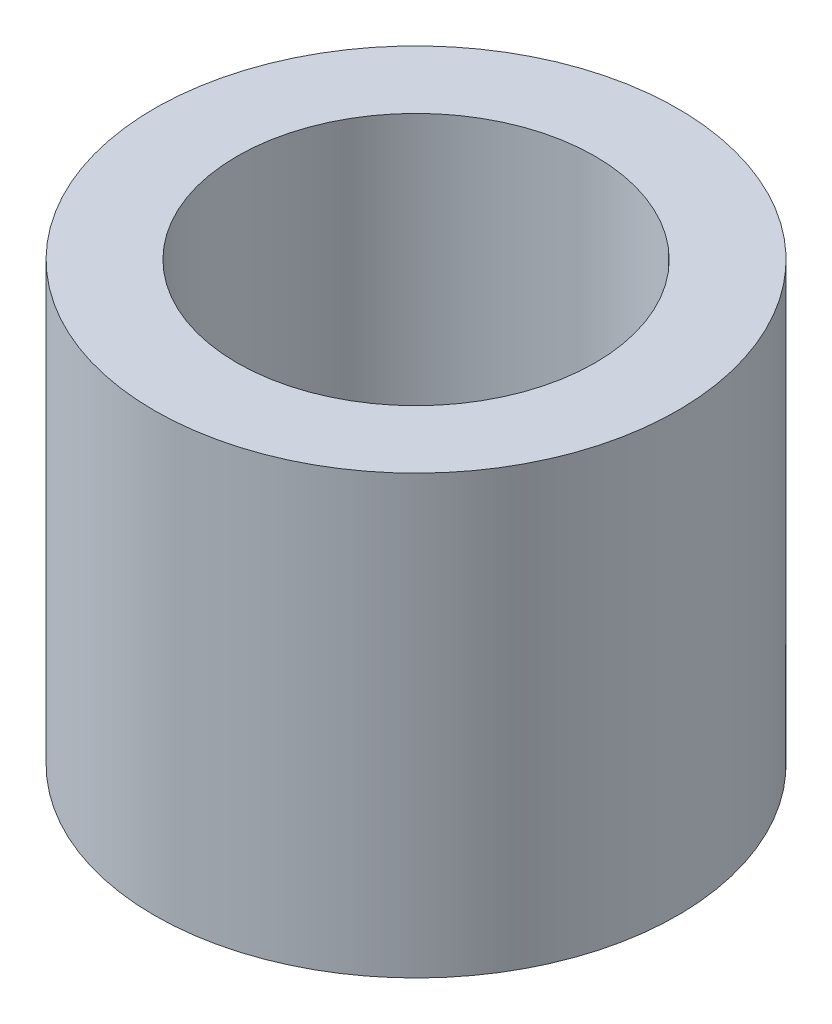
ISO-10303-21;
HEADER;
FILE_DESCRIPTION(('STEP AP214'),'2;1');
FILE_NAME('part.step','',(''),(''),'','','');
FILE_SCHEMA(('AUTOMOTIVE_DESIGN { 1 0 10303 214 1 1 1 1 }'));
ENDSEC;
DATA;
#1=APPLICATION_CONTEXT('core data for automotive mechanical design processes');
#2=APPLICATION_PROTOCOL_DEFINITION('international standard','automotive_design',2000,#1);
#3=PRODUCT_CONTEXT('',#1,'mechanical');
#4=PRODUCT('Part','Part','',(#3));
#5=PRODUCT_RELATED_PRODUCT_CATEGORY('part','',(#4));
#6=PRODUCT_DEFINITION_FORMATION('','',#4);
#7=PRODUCT_DEFINITION_CONTEXT('part definition',#1,'design');
#8=PRODUCT_DEFINITION('design','',#6,#7);
#9=PRODUCT_DEFINITION_SHAPE('','',#8);
#10=(LENGTH_UNIT() NAMED_UNIT(*) SI_UNIT(.MILLI.,.METRE.));
#11=(NAMED_UNIT(*) PLANE_ANGLE_UNIT() SI_UNIT($,.RADIAN.));
#12=(NAMED_UNIT(*) SI_UNIT($,.STERADIAN.) SOLID_ANGLE_UNIT());
#13=UNCERTAINTY_MEASURE_WITH_UNIT(LENGTH_MEASURE(1.E-05),#10,'distance_accuracy_value','');
#14=(GEOMETRIC_REPRESENTATION_CONTEXT(3) GLOBAL_UNCERTAINTY_ASSIGNED_CONTEXT((#13)) GLOBAL_UNIT_ASSIGNED_CONTEXT((#10,
#11,#12)) REPRESENTATION_CONTEXT('',''));
#15=CARTESIAN_POINT('',(0.,0.,0.));
#16=DIRECTION('',(0.,0.,1.));
#17=DIRECTION('',(1.,0.,0.));
#18=AXIS2_PLACEMENT_3D('',#15,#16,#17);
#19=CARTESIAN_POINT('',(0.,6.35,0.));
#20=DIRECTION('',(0.,1.,0.));
#21=DIRECTION('',(0.,0.,1.));
#22=AXIS2_PLACEMENT_3D('',#19,#20,#21);
#23=PLANE('',#22);
#24=CARTESIAN_POINT('',(0.,6.35,0.));
#25=DIRECTION('',(0.,1.,0.));
#26=DIRECTION('',(0.,0.,1.));
#27=AXIS2_PLACEMENT_3D('',#24,#25,#26);
#28=CIRCLE('',#27,3.8);
#29=CARTESIAN_POINT('',(0.,6.35,3.8));
#30=VERTEX_POINT('',#29);
#31=EDGE_CURVE('E10',#30,#30,#28,.T.);
#32=ORIENTED_EDGE('',*,*,#31,.T.);
#33=EDGE_LOOP('',(#32));
#34=FACE_BOUND('',#33,.T.);
#35=CARTESIAN_POINT('',(0.,6.35,0.));
#36=DIRECTION('',(0.,1.,0.));
#37=DIRECTION('',(0.,0.,1.));
#38=AXIS2_PLACEMENT_3D('',#35,#36,#37);
#39=CIRCLE('',#38,2.6);
#40=CARTESIAN_POINT('',(0.,6.35,2.6));
#41=VERTEX_POINT('',#40);
#42=EDGE_CURVE('E42',#41,#41,#39,.T.);
#43=ORIENTED_EDGE('',*,*,#42,.F.);
#44=EDGE_LOOP('',(#43));
#45=FACE_BOUND('',#44,.T.);
#46=ADVANCED_FACE('F31',(#34,#45),#23,.T.);
#47=CARTESIAN_POINT('',(0.,0.,0.));
#48=DIRECTION('',(0.,1.,0.));
#49=DIRECTION('',(0.,0.,1.));
#50=AXIS2_PLACEMENT_3D('',#47,#48,#49);
#51=PLANE('',#50);
#52=CARTESIAN_POINT('',(0.,0.,0.));
#53=DIRECTION('',(0.,1.,0.));
#54=DIRECTION('',(0.,0.,1.));
#55=AXIS2_PLACEMENT_3D('',#52,#53,#54);
#56=CIRCLE('',#55,3.8);
#57=CARTESIAN_POINT('',(0.,0.,3.8));
#58=VERTEX_POINT('',#57);
#59=EDGE_CURVE('E35',#58,#58,#56,.T.);
#60=ORIENTED_EDGE('',*,*,#59,.F.);
#61=EDGE_LOOP('',(#60));
#62=FACE_BOUND('',#61,.T.);
#63=CARTESIAN_POINT('',(0.,0.,0.));
#64=DIRECTION('',(0.,1.,0.));
#65=DIRECTION('',(0.,0.,1.));
#66=AXIS2_PLACEMENT_3D('',#63,#64,#65);
#67=CIRCLE('',#66,2.6);
#68=CARTESIAN_POINT('',(0.,0.,2.6));
#69=VERTEX_POINT('',#68);
#70=EDGE_CURVE('E44',#69,#69,#67,.T.);
#71=ORIENTED_EDGE('',*,*,#70,.T.);
#72=EDGE_LOOP('',(#71));
#73=FACE_BOUND('',#72,.T.);
#74=ADVANCED_FACE('F54',(#62,#73),#51,.F.);
#75=CARTESIAN_POINT('',(0.,6.35,0.));
#76=DIRECTION('',(0.,-1.,0.));
#77=DIRECTION('',(0.,0.,-1.));
#78=AXIS2_PLACEMENT_3D('',#75,#76,#77);
#79=CYLINDRICAL_SURFACE('',#78,3.8);
#80=ORIENTED_EDGE('',*,*,#31,.F.);
#81=EDGE_LOOP('',(#80));
#82=FACE_BOUND('',#81,.T.);
#83=ORIENTED_EDGE('',*,*,#59,.T.);
#84=EDGE_LOOP('',(#83));
#85=FACE_BOUND('',#84,.T.);
#86=ADVANCED_FACE('F33',(#82,#85),#79,.T.);
#87=CARTESIAN_POINT('',(0.,6.35,0.));
#88=DIRECTION('',(0.,-1.,0.));
#89=DIRECTION('',(0.,0.,-1.));
#90=AXIS2_PLACEMENT_3D('',#87,#88,#89);
#91=CYLINDRICAL_SURFACE('',#90,2.6);
#92=ORIENTED_EDGE('',*,*,#42,.T.);
#93=EDGE_LOOP('',(#92));
#94=FACE_BOUND('',#93,.T.);
#95=ORIENTED_EDGE('',*,*,#70,.F.);
#96=EDGE_LOOP('',(#95));
#97=FACE_BOUND('',#96,.T.);
#98=ADVANCED_FACE('F50',(#94,#97),#91,.F.);
#99=CLOSED_SHELL('',(#46,#74,#86,#98));
#100=MANIFOLD_SOLID_BREP('B2',#99);
#101=ADVANCED_BREP_SHAPE_REPRESENTATION('',(#18,#100),#14);
#102=SHAPE_DEFINITION_REPRESENTATION(#9,#101);
ENDSEC;
END-ISO-10303-21;
